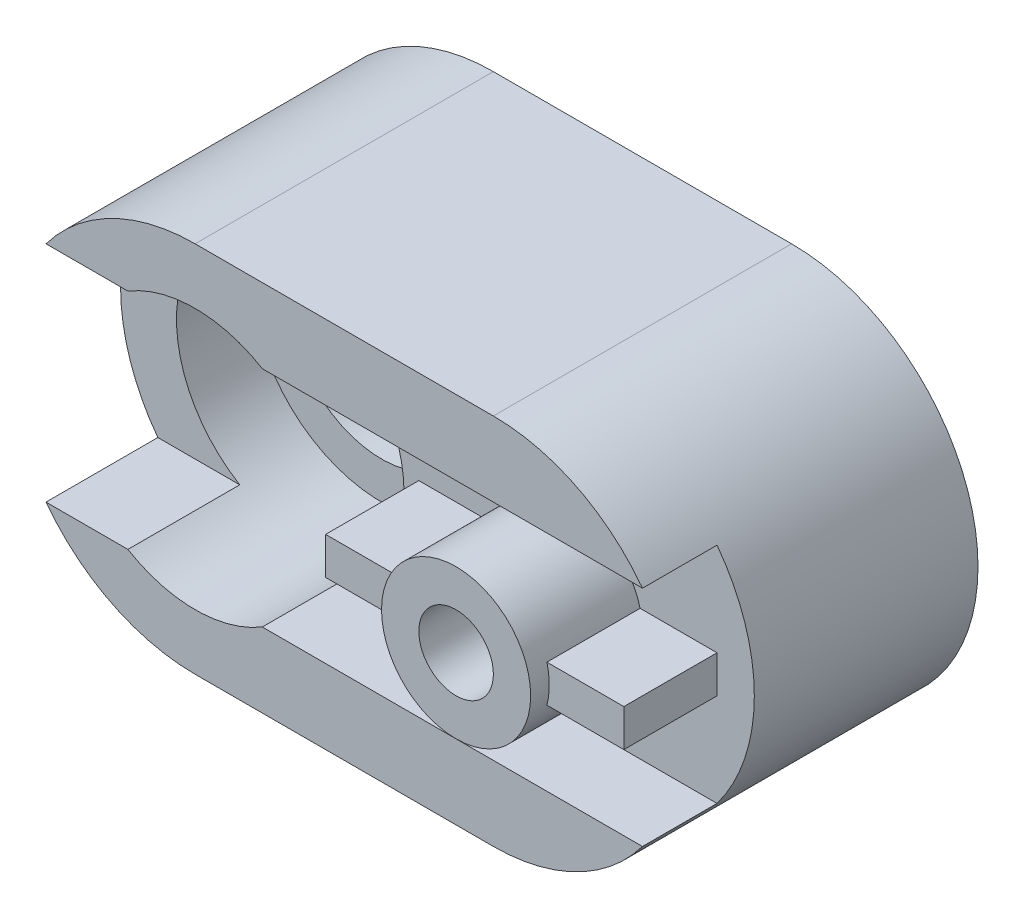
ISO-10303-21;
HEADER;
FILE_DESCRIPTION(('STEP AP214'),'2;1');
FILE_NAME('part.step','',(''),(''),'','','');
FILE_SCHEMA(('AUTOMOTIVE_DESIGN { 1 0 10303 214 1 1 1 1 }'));
ENDSEC;
DATA;
#1=APPLICATION_CONTEXT('core data for automotive mechanical design processes');
#2=APPLICATION_PROTOCOL_DEFINITION('international standard','automotive_design',2000,#1);
#3=PRODUCT_CONTEXT('',#1,'mechanical');
#4=PRODUCT('Part','Part','',(#3));
#5=PRODUCT_RELATED_PRODUCT_CATEGORY('part','',(#4));
#6=PRODUCT_DEFINITION_FORMATION('','',#4);
#7=PRODUCT_DEFINITION_CONTEXT('part definition',#1,'design');
#8=PRODUCT_DEFINITION('design','',#6,#7);
#9=PRODUCT_DEFINITION_SHAPE('','',#8);
#10=(LENGTH_UNIT() NAMED_UNIT(*) SI_UNIT(.MILLI.,.METRE.));
#11=(NAMED_UNIT(*) PLANE_ANGLE_UNIT() SI_UNIT($,.RADIAN.));
#12=(NAMED_UNIT(*) SI_UNIT($,.STERADIAN.) SOLID_ANGLE_UNIT());
#13=UNCERTAINTY_MEASURE_WITH_UNIT(LENGTH_MEASURE(1.E-05),#10,'distance_accuracy_value','');
#14=(GEOMETRIC_REPRESENTATION_CONTEXT(3) GLOBAL_UNCERTAINTY_ASSIGNED_CONTEXT((#13)) GLOBAL_UNIT_ASSIGNED_CONTEXT((#10,
#11,#12)) REPRESENTATION_CONTEXT('',''));
#15=CARTESIAN_POINT('',(0.,0.,0.));
#16=DIRECTION('',(0.,0.,1.));
#17=DIRECTION('',(1.,0.,0.));
#18=AXIS2_PLACEMENT_3D('',#15,#16,#17);
#19=CARTESIAN_POINT('',(209.,80.,60.));
#20=DIRECTION('',(0.,0.,1.));
#21=DIRECTION('',(1.,0.,0.));
#22=AXIS2_PLACEMENT_3D('',#19,#20,#21);
#23=PLANE('',#22);
#24=DIRECTION('',(-1.,0.,0.));
#25=VECTOR('',#24,1.);
#26=CARTESIAN_POINT('',(0.,55.,60.));
#27=LINE('',#26,#25);
#28=CARTESIAN_POINT('',(170.,55.,60.));
#29=VERTEX_POINT('',#28);
#30=CARTESIAN_POINT('',(149.364916731037,55.,60.));
#31=VERTEX_POINT('',#30);
#32=EDGE_CURVE('E204',#29,#31,#27,.T.);
#33=ORIENTED_EDGE('',*,*,#32,.F.);
#34=DIRECTION('',(0.,-1.,0.));
#35=VECTOR('',#34,1.);
#36=CARTESIAN_POINT('',(170.,0.,60.));
#37=LINE('',#36,#35);
#38=CARTESIAN_POINT('',(170.,45.,60.));
#39=VERTEX_POINT('',#38);
#40=EDGE_CURVE('E50',#29,#39,#37,.T.);
#41=ORIENTED_EDGE('',*,*,#40,.T.);
#42=DIRECTION('',(-1.,0.,0.));
#43=VECTOR('',#42,1.);
#44=CARTESIAN_POINT('',(0.,45.,60.));
#45=LINE('',#44,#43);
#46=CARTESIAN_POINT('',(149.364916731037,45.,60.));
#47=VERTEX_POINT('',#46);
#48=EDGE_CURVE('E237',#39,#47,#45,.T.);
#49=ORIENTED_EDGE('',*,*,#48,.T.);
#50=CARTESIAN_POINT('',(130.,50.,60.));
#51=DIRECTION('',(0.,0.,-1.));
#52=DIRECTION('',(1.,0.,0.));
#53=AXIS2_PLACEMENT_3D('',#50,#51,#52);
#54=CIRCLE('',#53,20.);
#55=CARTESIAN_POINT('',(110.635083268963,45.,60.));
#56=VERTEX_POINT('',#55);
#57=EDGE_CURVE('E296',#47,#56,#54,.T.);
#58=ORIENTED_EDGE('',*,*,#57,.T.);
#59=DIRECTION('',(1.,0.,0.));
#60=VECTOR('',#59,1.);
#61=CARTESIAN_POINT('',(0.,45.,60.));
#62=LINE('',#61,#60);
#63=CARTESIAN_POINT('',(90.,45.,60.));
#64=VERTEX_POINT('',#63);
#65=EDGE_CURVE('E224',#64,#56,#62,.T.);
#66=ORIENTED_EDGE('',*,*,#65,.F.);
#67=DIRECTION('',(0.,-1.,0.));
#68=VECTOR('',#67,1.);
#69=CARTESIAN_POINT('',(90.,0.,60.));
#70=LINE('',#69,#68);
#71=CARTESIAN_POINT('',(90.,55.,60.));
#72=VERTEX_POINT('',#71);
#73=EDGE_CURVE('E218',#72,#64,#70,.T.);
#74=ORIENTED_EDGE('',*,*,#73,.F.);
#75=DIRECTION('',(1.,0.,0.));
#76=VECTOR('',#75,1.);
#77=CARTESIAN_POINT('',(0.,55.,60.));
#78=LINE('',#77,#76);
#79=CARTESIAN_POINT('',(110.635083268963,55.,60.));
#80=VERTEX_POINT('',#79);
#81=EDGE_CURVE('E209',#72,#80,#78,.T.);
#82=ORIENTED_EDGE('',*,*,#81,.T.);
#83=EDGE_CURVE('E295',#80,#31,#54,.T.);
#84=ORIENTED_EDGE('',*,*,#83,.T.);
#85=EDGE_LOOP('',(#33,#41,#49,#58,#66,#74,#82,#84));
#86=FACE_BOUND('',#85,.T.);
#87=DIRECTION('',(-1.,0.,0.));
#88=VECTOR('',#87,1.);
#89=CARTESIAN_POINT('',(209.,80.,60.));
#90=LINE('',#89,#88);
#91=CARTESIAN_POINT('',(170.,80.,60.));
#92=VERTEX_POINT('',#91);
#93=CARTESIAN_POINT('',(70.,80.,60.));
#94=VERTEX_POINT('',#93);
#95=EDGE_CURVE('E317',#92,#94,#90,.T.);
#96=ORIENTED_EDGE('',*,*,#95,.T.);
#97=CARTESIAN_POINT('',(50.,50.,60.));
#98=DIRECTION('',(0.,0.,1.));
#99=DIRECTION('',(1.,0.,0.));
#100=AXIS2_PLACEMENT_3D('',#97,#98,#99);
#101=CIRCLE('',#100,36.0555127546399);
#102=CARTESIAN_POINT('',(70.,20.,60.));
#103=VERTEX_POINT('',#102);
#104=EDGE_CURVE('E265',#94,#103,#101,.F.);
#105=ORIENTED_EDGE('',*,*,#104,.T.);
#106=DIRECTION('',(-1.,0.,0.));
#107=VECTOR('',#106,1.);
#108=CARTESIAN_POINT('',(209.,20.,60.));
#109=LINE('',#108,#107);
#110=CARTESIAN_POINT('',(170.,20.,60.));
#111=VERTEX_POINT('',#110);
#112=EDGE_CURVE('E308',#111,#103,#109,.T.);
#113=ORIENTED_EDGE('',*,*,#112,.F.);
#114=CARTESIAN_POINT('',(130.,50.,60.));
#115=DIRECTION('',(0.,0.,1.));
#116=DIRECTION('',(1.,0.,0.));
#117=AXIS2_PLACEMENT_3D('',#114,#115,#116);
#118=CIRCLE('',#117,50.);
#119=EDGE_CURVE('E326',#92,#111,#118,.F.);
#120=ORIENTED_EDGE('',*,*,#119,.F.);
#121=EDGE_LOOP('',(#96,#105,#113,#120));
#122=FACE_BOUND('',#121,.T.);
#123=ADVANCED_FACE('F35',(#86,#122),#23,.T.);
#124=CARTESIAN_POINT('',(130.,50.,90.));
#125=DIRECTION('',(0.,0.,-1.));
#126=DIRECTION('',(-1.,0.,0.));
#127=AXIS2_PLACEMENT_3D('',#124,#125,#126);
#128=CYLINDRICAL_SURFACE('',#127,20.);
#129=CARTESIAN_POINT('',(130.,50.,90.));
#130=DIRECTION('',(0.,0.,1.));
#131=DIRECTION('',(1.,0.,0.));
#132=AXIS2_PLACEMENT_3D('',#129,#130,#131);
#133=CIRCLE('',#132,20.);
#134=CARTESIAN_POINT('',(150.,50.,90.));
#135=VERTEX_POINT('',#134);
#136=EDGE_CURVE('E305',#135,#135,#133,.T.);
#137=ORIENTED_EDGE('',*,*,#136,.F.);
#138=EDGE_LOOP('',(#137));
#139=FACE_BOUND('',#138,.T.);
#140=CARTESIAN_POINT('',(130.,50.,85.));
#141=DIRECTION('',(0.,0.,1.));
#142=DIRECTION('',(1.,0.,0.));
#143=AXIS2_PLACEMENT_3D('',#140,#141,#142);
#144=CIRCLE('',#143,20.);
#145=CARTESIAN_POINT('',(149.364916731037,55.,85.));
#146=VERTEX_POINT('',#145);
#147=CARTESIAN_POINT('',(149.364916731037,45.,85.));
#148=VERTEX_POINT('',#147);
#149=EDGE_CURVE('E58',#146,#148,#144,.F.);
#150=ORIENTED_EDGE('',*,*,#149,.F.);
#151=DIRECTION('',(0.,0.,1.));
#152=VECTOR('',#151,1.);
#153=CARTESIAN_POINT('',(149.364916731037,55.,60.));
#154=LINE('',#153,#152);
#155=EDGE_CURVE('E201',#31,#146,#154,.T.);
#156=ORIENTED_EDGE('',*,*,#155,.F.);
#157=ORIENTED_EDGE('',*,*,#83,.F.);
#158=DIRECTION('',(0.,0.,1.));
#159=VECTOR('',#158,1.);
#160=CARTESIAN_POINT('',(110.635083268963,55.,60.));
#161=LINE('',#160,#159);
#162=CARTESIAN_POINT('',(110.635083268963,55.,85.));
#163=VERTEX_POINT('',#162);
#164=EDGE_CURVE('E212',#80,#163,#161,.T.);
#165=ORIENTED_EDGE('',*,*,#164,.T.);
#166=CARTESIAN_POINT('',(130.,50.,85.));
#167=DIRECTION('',(0.,0.,1.));
#168=DIRECTION('',(1.,0.,0.));
#169=AXIS2_PLACEMENT_3D('',#166,#167,#168);
#170=CIRCLE('',#169,20.);
#171=CARTESIAN_POINT('',(110.635083268963,45.,85.));
#172=VERTEX_POINT('',#171);
#173=EDGE_CURVE('E221',#172,#163,#170,.F.);
#174=ORIENTED_EDGE('',*,*,#173,.F.);
#175=DIRECTION('',(0.,0.,-1.));
#176=VECTOR('',#175,1.);
#177=CARTESIAN_POINT('',(110.635083268963,45.,85.));
#178=LINE('',#177,#176);
#179=EDGE_CURVE('E229',#172,#56,#178,.T.);
#180=ORIENTED_EDGE('',*,*,#179,.T.);
#181=ORIENTED_EDGE('',*,*,#57,.F.);
#182=DIRECTION('',(0.,0.,-1.));
#183=VECTOR('',#182,1.);
#184=CARTESIAN_POINT('',(149.364916731037,45.,85.));
#185=LINE('',#184,#183);
#186=EDGE_CURVE('E240',#148,#47,#185,.T.);
#187=ORIENTED_EDGE('',*,*,#186,.F.);
#188=EDGE_LOOP('',(#150,#156,#157,#165,#174,#180,#181,#187));
#189=FACE_BOUND('',#188,.T.);
#190=ADVANCED_FACE('F444',(#139,#189),#128,.T.);
#191=CARTESIAN_POINT('',(209.,80.,80.));
#192=DIRECTION('',(0.,-1.,0.));
#193=DIRECTION('',(0.,0.,-1.));
#194=AXIS2_PLACEMENT_3D('',#191,#192,#193);
#195=PLANE('',#194);
#196=DIRECTION('',(1.,0.,0.));
#197=VECTOR('',#196,1.);
#198=CARTESIAN_POINT('',(0.,80.,80.));
#199=LINE('',#198,#197);
#200=CARTESIAN_POINT('',(68.02775637732,80.,80.));
#201=VERTEX_POINT('',#200);
#202=CARTESIAN_POINT('',(170.,80.,80.));
#203=VERTEX_POINT('',#202);
#204=EDGE_CURVE('E362',#201,#203,#199,.T.);
#205=ORIENTED_EDGE('',*,*,#204,.F.);
#206=DIRECTION('',(0.,0.,1.));
#207=VECTOR('',#206,1.);
#208=CARTESIAN_POINT('',(68.02775637732,80.,30.));
#209=LINE('',#208,#207);
#210=CARTESIAN_POINT('',(68.02775637732,80.,50.));
#211=VERTEX_POINT('',#210);
#212=EDGE_CURVE('E259',#211,#201,#209,.T.);
#213=ORIENTED_EDGE('',*,*,#212,.F.);
#214=DIRECTION('',(-1.,0.,0.));
#215=VECTOR('',#214,1.);
#216=CARTESIAN_POINT('',(0.,80.,50.));
#217=LINE('',#216,#215);
#218=CARTESIAN_POINT('',(70.,80.,50.));
#219=VERTEX_POINT('',#218);
#220=EDGE_CURVE('E270',#219,#211,#217,.T.);
#221=ORIENTED_EDGE('',*,*,#220,.F.);
#222=DIRECTION('',(0.,0.,1.));
#223=VECTOR('',#222,1.);
#224=CARTESIAN_POINT('',(70.,80.,50.));
#225=LINE('',#224,#223);
#226=EDGE_CURVE('E280',#219,#94,#225,.T.);
#227=ORIENTED_EDGE('',*,*,#226,.T.);
#228=ORIENTED_EDGE('',*,*,#95,.F.);
#229=DIRECTION('',(0.,0.,-1.));
#230=VECTOR('',#229,1.);
#231=CARTESIAN_POINT('',(170.,80.,80.));
#232=LINE('',#231,#230);
#233=EDGE_CURVE('E323',#203,#92,#232,.T.);
#234=ORIENTED_EDGE('',*,*,#233,.F.);
#235=EDGE_LOOP('',(#205,#213,#221,#227,#228,#234));
#236=FACE_BOUND('',#235,.T.);
#237=ADVANCED_FACE('F414',(#236),#195,.T.);
#238=CARTESIAN_POINT('',(209.,20.,80.));
#239=DIRECTION('',(0.,1.,0.));
#240=DIRECTION('',(0.,0.,1.));
#241=AXIS2_PLACEMENT_3D('',#238,#239,#240);
#242=PLANE('',#241);
#243=DIRECTION('',(-1.,0.,0.));
#244=VECTOR('',#243,1.);
#245=CARTESIAN_POINT('',(0.,20.,80.));
#246=LINE('',#245,#244);
#247=CARTESIAN_POINT('',(31.9722436226801,20.,80.));
#248=VERTEX_POINT('',#247);
#249=CARTESIAN_POINT('',(10.,20.,80.));
#250=VERTEX_POINT('',#249);
#251=EDGE_CURVE('E365',#248,#250,#246,.T.);
#252=ORIENTED_EDGE('',*,*,#251,.F.);
#253=DIRECTION('',(0.,0.,1.));
#254=VECTOR('',#253,1.);
#255=CARTESIAN_POINT('',(31.9722436226801,20.,30.));
#256=LINE('',#255,#254);
#257=CARTESIAN_POINT('',(31.9722436226801,20.,50.));
#258=VERTEX_POINT('',#257);
#259=EDGE_CURVE('E261',#258,#248,#256,.T.);
#260=ORIENTED_EDGE('',*,*,#259,.F.);
#261=DIRECTION('',(1.,0.,0.));
#262=VECTOR('',#261,1.);
#263=CARTESIAN_POINT('',(0.,20.,50.));
#264=LINE('',#263,#262);
#265=CARTESIAN_POINT('',(10.,20.,50.));
#266=VERTEX_POINT('',#265);
#267=EDGE_CURVE('E277',#266,#258,#264,.T.);
#268=ORIENTED_EDGE('',*,*,#267,.F.);
#269=DIRECTION('',(0.,0.,-1.));
#270=VECTOR('',#269,1.);
#271=CARTESIAN_POINT('',(10.,20.,80.));
#272=LINE('',#271,#270);
#273=EDGE_CURVE('E311',#266,#250,#272,.F.);
#274=ORIENTED_EDGE('',*,*,#273,.T.);
#275=EDGE_LOOP('',(#252,#260,#268,#274));
#276=FACE_BOUND('',#275,.T.);
#277=ADVANCED_FACE('F379',(#276),#242,.T.);
#278=CARTESIAN_POINT('',(50.,50.,20.));
#279=DIRECTION('',(0.,0.,1.));
#280=DIRECTION('',(1.,0.,0.));
#281=AXIS2_PLACEMENT_3D('',#278,#279,#280);
#282=CYLINDRICAL_SURFACE('',#281,25.);
#283=CARTESIAN_POINT('',(50.,50.,20.));
#284=DIRECTION('',(0.,0.,1.));
#285=DIRECTION('',(1.,0.,0.));
#286=AXIS2_PLACEMENT_3D('',#283,#284,#285);
#287=CIRCLE('',#286,25.);
#288=CARTESIAN_POINT('',(75.,50.,20.));
#289=VERTEX_POINT('',#288);
#290=EDGE_CURVE('E289',#289,#289,#287,.T.);
#291=ORIENTED_EDGE('',*,*,#290,.F.);
#292=EDGE_LOOP('',(#291));
#293=FACE_BOUND('',#292,.T.);
#294=CARTESIAN_POINT('',(50.,50.,30.));
#295=DIRECTION('',(0.,0.,1.));
#296=DIRECTION('',(1.,0.,0.));
#297=AXIS2_PLACEMENT_3D('',#294,#295,#296);
#298=CIRCLE('',#297,25.);
#299=CARTESIAN_POINT('',(75.,50.,30.));
#300=VERTEX_POINT('',#299);
#301=EDGE_CURVE('E251',#300,#300,#298,.T.);
#302=ORIENTED_EDGE('',*,*,#301,.T.);
#303=EDGE_LOOP('',(#302));
#304=FACE_BOUND('',#303,.T.);
#305=ADVANCED_FACE('F552',(#293,#304),#282,.F.);
#306=CARTESIAN_POINT('',(0.,0.,50.));
#307=DIRECTION('',(0.,0.,1.));
#308=DIRECTION('',(1.,0.,0.));
#309=AXIS2_PLACEMENT_3D('',#306,#307,#308);
#310=PLANE('',#309);
#311=CARTESIAN_POINT('',(50.,50.,50.));
#312=DIRECTION('',(0.,0.,1.));
#313=DIRECTION('',(1.,0.,0.));
#314=AXIS2_PLACEMENT_3D('',#311,#312,#313);
#315=CIRCLE('',#314,35.);
#316=CARTESIAN_POINT('',(31.9722436226801,80.,50.));
#317=VERTEX_POINT('',#316);
#318=EDGE_CURVE('E11',#317,#258,#315,.T.);
#319=ORIENTED_EDGE('',*,*,#318,.F.);
#320=CARTESIAN_POINT('',(10.,80.,50.));
#321=VERTEX_POINT('',#320);
#322=EDGE_CURVE('E269',#317,#321,#217,.T.);
#323=ORIENTED_EDGE('',*,*,#322,.T.);
#324=CARTESIAN_POINT('',(50.,50.,50.));
#325=DIRECTION('',(0.,0.,1.));
#326=DIRECTION('',(1.,0.,0.));
#327=AXIS2_PLACEMENT_3D('',#324,#325,#326);
#328=CIRCLE('',#327,50.);
#329=EDGE_CURVE('E273',#321,#266,#328,.T.);
#330=ORIENTED_EDGE('',*,*,#329,.T.);
#331=ORIENTED_EDGE('',*,*,#267,.T.);
#332=EDGE_LOOP('',(#319,#323,#330,#331));
#333=FACE_BOUND('',#332,.T.);
#334=ADVANCED_FACE('F424',(#333),#310,.T.);
#335=CARTESIAN_POINT('',(50.,50.,-14.));
#336=DIRECTION('',(0.,0.,1.));
#337=DIRECTION('',(1.,0.,0.));
#338=AXIS2_PLACEMENT_3D('',#335,#336,#337);
#339=CYLINDRICAL_SURFACE('',#338,10.);
#340=CARTESIAN_POINT('',(50.,50.,0.));
#341=DIRECTION('',(0.,0.,1.));
#342=DIRECTION('',(1.,0.,0.));
#343=AXIS2_PLACEMENT_3D('',#340,#341,#342);
#344=CIRCLE('',#343,10.);
#345=CARTESIAN_POINT('',(60.,50.,0.));
#346=VERTEX_POINT('',#345);
#347=EDGE_CURVE('E292',#346,#346,#344,.T.);
#348=ORIENTED_EDGE('',*,*,#347,.F.);
#349=EDGE_LOOP('',(#348));
#350=FACE_BOUND('',#349,.T.);
#351=CARTESIAN_POINT('',(50.,50.,20.));
#352=DIRECTION('',(0.,0.,1.));
#353=DIRECTION('',(1.,0.,0.));
#354=AXIS2_PLACEMENT_3D('',#351,#352,#353);
#355=CIRCLE('',#354,10.);
#356=CARTESIAN_POINT('',(60.,50.,20.));
#357=VERTEX_POINT('',#356);
#358=EDGE_CURVE('E285',#357,#357,#355,.T.);
#359=ORIENTED_EDGE('',*,*,#358,.T.);
#360=EDGE_LOOP('',(#359));
#361=FACE_BOUND('',#360,.T.);
#362=ADVANCED_FACE('F461',(#350,#361),#339,.F.);
#363=CARTESIAN_POINT('',(50.,50.,80.));
#364=DIRECTION('',(0.,0.,-1.));
#365=DIRECTION('',(-1.,0.,0.));
#366=AXIS2_PLACEMENT_3D('',#363,#364,#365);
#367=CYLINDRICAL_SURFACE('',#366,50.);
#368=ORIENTED_EDGE('',*,*,#273,.F.);
#369=ORIENTED_EDGE('',*,*,#329,.F.);
#370=DIRECTION('',(0.,0.,-1.));
#371=VECTOR('',#370,1.);
#372=CARTESIAN_POINT('',(10.,80.,80.));
#373=LINE('',#372,#371);
#374=CARTESIAN_POINT('',(10.,80.,80.));
#375=VERTEX_POINT('',#374);
#376=EDGE_CURVE('E320',#375,#321,#373,.T.);
#377=ORIENTED_EDGE('',*,*,#376,.F.);
#378=CARTESIAN_POINT('',(50.,50.,80.));
#379=DIRECTION('',(0.,0.,1.));
#380=DIRECTION('',(1.,0.,0.));
#381=AXIS2_PLACEMENT_3D('',#378,#379,#380);
#382=CIRCLE('',#381,50.);
#383=CARTESIAN_POINT('',(50.,100.,80.));
#384=VERTEX_POINT('',#383);
#385=EDGE_CURVE('E337',#384,#375,#382,.T.);
#386=ORIENTED_EDGE('',*,*,#385,.F.);
#387=DIRECTION('',(0.,0.,-1.));
#388=VECTOR('',#387,1.);
#389=CARTESIAN_POINT('',(50.,100.,80.));
#390=LINE('',#389,#388);
#391=CARTESIAN_POINT('',(50.,100.,0.));
#392=VERTEX_POINT('',#391);
#393=EDGE_CURVE('E358',#384,#392,#390,.T.);
#394=ORIENTED_EDGE('',*,*,#393,.T.);
#395=CARTESIAN_POINT('',(50.,50.,0.));
#396=DIRECTION('',(0.,0.,1.));
#397=DIRECTION('',(1.,0.,0.));
#398=AXIS2_PLACEMENT_3D('',#395,#396,#397);
#399=CIRCLE('',#398,50.);
#400=CARTESIAN_POINT('',(50.,0.,0.));
#401=VERTEX_POINT('',#400);
#402=EDGE_CURVE('E349',#392,#401,#399,.T.);
#403=ORIENTED_EDGE('',*,*,#402,.T.);
#404=DIRECTION('',(0.,0.,-1.));
#405=VECTOR('',#404,1.);
#406=CARTESIAN_POINT('',(50.,0.,80.));
#407=LINE('',#406,#405);
#408=CARTESIAN_POINT('',(50.,0.,80.));
#409=VERTEX_POINT('',#408);
#410=EDGE_CURVE('E355',#409,#401,#407,.T.);
#411=ORIENTED_EDGE('',*,*,#410,.F.);
#412=EDGE_CURVE('E336',#250,#409,#382,.T.);
#413=ORIENTED_EDGE('',*,*,#412,.F.);
#414=EDGE_LOOP('',(#368,#369,#377,#386,#394,#403,#411,#413));
#415=FACE_BOUND('',#414,.T.);
#416=ADVANCED_FACE('F382',(#415),#367,.T.);
#417=CARTESIAN_POINT('',(130.,50.,80.));
#418=DIRECTION('',(0.,0.,-1.));
#419=DIRECTION('',(-1.,0.,0.));
#420=AXIS2_PLACEMENT_3D('',#417,#418,#419);
#421=CYLINDRICAL_SURFACE('',#420,50.);
#422=ORIENTED_EDGE('',*,*,#119,.T.);
#423=DIRECTION('',(0.,0.,-1.));
#424=VECTOR('',#423,1.);
#425=CARTESIAN_POINT('',(170.,20.,80.));
#426=LINE('',#425,#424);
#427=CARTESIAN_POINT('',(170.,20.,80.));
#428=VERTEX_POINT('',#427);
#429=EDGE_CURVE('E314',#111,#428,#426,.F.);
#430=ORIENTED_EDGE('',*,*,#429,.T.);
#431=CARTESIAN_POINT('',(130.,50.,80.));
#432=DIRECTION('',(0.,0.,1.));
#433=DIRECTION('',(1.,0.,0.));
#434=AXIS2_PLACEMENT_3D('',#431,#432,#433);
#435=CIRCLE('',#434,50.);
#436=CARTESIAN_POINT('',(130.,0.,80.));
#437=VERTEX_POINT('',#436);
#438=EDGE_CURVE('E333',#428,#437,#435,.F.);
#439=ORIENTED_EDGE('',*,*,#438,.T.);
#440=DIRECTION('',(0.,0.,-1.));
#441=VECTOR('',#440,1.);
#442=CARTESIAN_POINT('',(130.,0.,80.));
#443=LINE('',#442,#441);
#444=CARTESIAN_POINT('',(130.,0.,0.));
#445=VERTEX_POINT('',#444);
#446=EDGE_CURVE('E343',#437,#445,#443,.T.);
#447=ORIENTED_EDGE('',*,*,#446,.T.);
#448=CARTESIAN_POINT('',(130.,50.,0.));
#449=DIRECTION('',(0.,0.,1.));
#450=DIRECTION('',(1.,0.,0.));
#451=AXIS2_PLACEMENT_3D('',#448,#449,#450);
#452=CIRCLE('',#451,50.);
#453=CARTESIAN_POINT('',(130.,100.,0.));
#454=VERTEX_POINT('',#453);
#455=EDGE_CURVE('E328',#454,#445,#452,.F.);
#456=ORIENTED_EDGE('',*,*,#455,.F.);
#457=DIRECTION('',(0.,0.,-1.));
#458=VECTOR('',#457,1.);
#459=CARTESIAN_POINT('',(130.,100.,80.));
#460=LINE('',#459,#458);
#461=CARTESIAN_POINT('',(130.,100.,80.));
#462=VERTEX_POINT('',#461);
#463=EDGE_CURVE('E360',#462,#454,#460,.T.);
#464=ORIENTED_EDGE('',*,*,#463,.F.);
#465=EDGE_CURVE('E329',#462,#203,#435,.F.);
#466=ORIENTED_EDGE('',*,*,#465,.T.);
#467=ORIENTED_EDGE('',*,*,#233,.T.);
#468=EDGE_LOOP('',(#422,#430,#439,#447,#456,#464,#466,#467));
#469=FACE_BOUND('',#468,.T.);
#470=ADVANCED_FACE('F37',(#469),#421,.T.);
#471=CARTESIAN_POINT('',(0.,0.,80.));
#472=DIRECTION('',(0.,0.,1.));
#473=DIRECTION('',(1.,0.,0.));
#474=AXIS2_PLACEMENT_3D('',#471,#472,#473);
#475=PLANE('',#474);
#476=CARTESIAN_POINT('',(50.,50.,80.));
#477=DIRECTION('',(0.,0.,1.));
#478=DIRECTION('',(1.,0.,0.));
#479=AXIS2_PLACEMENT_3D('',#476,#477,#478);
#480=CIRCLE('',#479,35.);
#481=CARTESIAN_POINT('',(68.0277563773199,20.,80.));
#482=VERTEX_POINT('',#481);
#483=EDGE_CURVE('E247',#248,#482,#480,.T.);
#484=ORIENTED_EDGE('',*,*,#483,.F.);
#485=ORIENTED_EDGE('',*,*,#251,.T.);
#486=ORIENTED_EDGE('',*,*,#412,.T.);
#487=DIRECTION('',(1.,0.,0.));
#488=VECTOR('',#487,1.);
#489=CARTESIAN_POINT('',(0.,0.,80.));
#490=LINE('',#489,#488);
#491=EDGE_CURVE('E340',#409,#437,#490,.T.);
#492=ORIENTED_EDGE('',*,*,#491,.T.);
#493=ORIENTED_EDGE('',*,*,#438,.F.);
#494=EDGE_CURVE('E366',#428,#482,#246,.T.);
#495=ORIENTED_EDGE('',*,*,#494,.T.);
#496=EDGE_LOOP('',(#484,#485,#486,#492,#493,#495));
#497=FACE_BOUND('',#496,.T.);
#498=ADVANCED_FACE('F372',(#497),#475,.T.);
#499=CARTESIAN_POINT('',(31.9722436226801,80.,80.));
#500=VERTEX_POINT('',#499);
#501=EDGE_CURVE('E248',#201,#500,#480,.T.);
#502=ORIENTED_EDGE('',*,*,#501,.F.);
#503=ORIENTED_EDGE('',*,*,#204,.T.);
#504=ORIENTED_EDGE('',*,*,#465,.F.);
#505=DIRECTION('',(1.,0.,0.));
#506=VECTOR('',#505,1.);
#507=CARTESIAN_POINT('',(0.,100.,80.));
#508=LINE('',#507,#506);
#509=EDGE_CURVE('E332',#384,#462,#508,.T.);
#510=ORIENTED_EDGE('',*,*,#509,.F.);
#511=ORIENTED_EDGE('',*,*,#385,.T.);
#512=EDGE_CURVE('E363',#375,#500,#199,.T.);
#513=ORIENTED_EDGE('',*,*,#512,.T.);
#514=EDGE_LOOP('',(#502,#503,#504,#510,#511,#513));
#515=FACE_BOUND('',#514,.T.);
#516=ADVANCED_FACE('F418',(#515),#475,.T.);
#517=CARTESIAN_POINT('',(0.,100.,80.));
#518=DIRECTION('',(0.,1.,0.));
#519=DIRECTION('',(0.,0.,1.));
#520=AXIS2_PLACEMENT_3D('',#517,#518,#519);
#521=PLANE('',#520);
#522=DIRECTION('',(1.,0.,0.));
#523=VECTOR('',#522,1.);
#524=CARTESIAN_POINT('',(0.,100.,0.));
#525=LINE('',#524,#523);
#526=EDGE_CURVE('E346',#392,#454,#525,.T.);
#527=ORIENTED_EDGE('',*,*,#526,.F.);
#528=ORIENTED_EDGE('',*,*,#393,.F.);
#529=ORIENTED_EDGE('',*,*,#509,.T.);
#530=ORIENTED_EDGE('',*,*,#463,.T.);
#531=EDGE_LOOP('',(#527,#528,#529,#530));
#532=FACE_BOUND('',#531,.T.);
#533=ADVANCED_FACE('F430',(#532),#521,.T.);
#534=CARTESIAN_POINT('',(0.,0.,80.));
#535=DIRECTION('',(0.,1.,0.));
#536=DIRECTION('',(0.,0.,1.));
#537=AXIS2_PLACEMENT_3D('',#534,#535,#536);
#538=PLANE('',#537);
#539=DIRECTION('',(1.,0.,0.));
#540=VECTOR('',#539,1.);
#541=CARTESIAN_POINT('',(0.,0.,0.));
#542=LINE('',#541,#540);
#543=EDGE_CURVE('E351',#401,#445,#542,.T.);
#544=ORIENTED_EDGE('',*,*,#543,.T.);
#545=ORIENTED_EDGE('',*,*,#446,.F.);
#546=ORIENTED_EDGE('',*,*,#491,.F.);
#547=ORIENTED_EDGE('',*,*,#410,.T.);
#548=EDGE_LOOP('',(#544,#545,#546,#547));
#549=FACE_BOUND('',#548,.T.);
#550=ADVANCED_FACE('F388',(#549),#538,.F.);
#551=CARTESIAN_POINT('',(0.,0.,0.));
#552=DIRECTION('',(0.,0.,1.));
#553=DIRECTION('',(1.,0.,0.));
#554=AXIS2_PLACEMENT_3D('',#551,#552,#553);
#555=PLANE('',#554);
#556=ORIENTED_EDGE('',*,*,#347,.T.);
#557=EDGE_LOOP('',(#556));
#558=FACE_BOUND('',#557,.T.);
#559=ORIENTED_EDGE('',*,*,#455,.T.);
#560=ORIENTED_EDGE('',*,*,#543,.F.);
#561=ORIENTED_EDGE('',*,*,#402,.F.);
#562=ORIENTED_EDGE('',*,*,#526,.T.);
#563=EDGE_LOOP('',(#559,#560,#561,#562));
#564=FACE_BOUND('',#563,.T.);
#565=ADVANCED_FACE('F432',(#558,#564),#555,.F.);
#566=DIRECTION('',(0.,0.,1.));
#567=VECTOR('',#566,1.);
#568=CARTESIAN_POINT('',(31.9722436226801,80.,30.));
#569=LINE('',#568,#567);
#570=EDGE_CURVE('E263',#500,#317,#569,.F.);
#571=ORIENTED_EDGE('',*,*,#570,.F.);
#572=ORIENTED_EDGE('',*,*,#512,.F.);
#573=ORIENTED_EDGE('',*,*,#376,.T.);
#574=ORIENTED_EDGE('',*,*,#322,.F.);
#575=EDGE_LOOP('',(#571,#572,#573,#574));
#576=FACE_BOUND('',#575,.T.);
#577=ADVANCED_FACE('F425',(#576),#195,.T.);
#578=DIRECTION('',(0.,0.,1.));
#579=VECTOR('',#578,1.);
#580=CARTESIAN_POINT('',(68.0277563773199,20.,30.));
#581=LINE('',#580,#579);
#582=CARTESIAN_POINT('',(68.0277563773199,20.,50.));
#583=VERTEX_POINT('',#582);
#584=EDGE_CURVE('E257',#482,#583,#581,.F.);
#585=ORIENTED_EDGE('',*,*,#584,.F.);
#586=ORIENTED_EDGE('',*,*,#494,.F.);
#587=ORIENTED_EDGE('',*,*,#429,.F.);
#588=ORIENTED_EDGE('',*,*,#112,.T.);
#589=DIRECTION('',(0.,0.,1.));
#590=VECTOR('',#589,1.);
#591=CARTESIAN_POINT('',(70.,20.,50.));
#592=LINE('',#591,#590);
#593=CARTESIAN_POINT('',(70.,20.,50.));
#594=VERTEX_POINT('',#593);
#595=EDGE_CURVE('E283',#594,#103,#592,.T.);
#596=ORIENTED_EDGE('',*,*,#595,.F.);
#597=EDGE_CURVE('E276',#583,#594,#264,.T.);
#598=ORIENTED_EDGE('',*,*,#597,.F.);
#599=EDGE_LOOP('',(#585,#586,#587,#588,#596,#598));
#600=FACE_BOUND('',#599,.T.);
#601=ADVANCED_FACE('F394',(#600),#242,.T.);
#602=CARTESIAN_POINT('',(130.,50.,90.));
#603=DIRECTION('',(0.,0.,1.));
#604=DIRECTION('',(1.,0.,0.));
#605=AXIS2_PLACEMENT_3D('',#602,#603,#604);
#606=PLANE('',#605);
#607=ORIENTED_EDGE('',*,*,#136,.T.);
#608=EDGE_LOOP('',(#607));
#609=FACE_BOUND('',#608,.T.);
#610=CARTESIAN_POINT('',(130.,50.,90.));
#611=DIRECTION('',(0.,0.,1.));
#612=DIRECTION('',(1.,0.,0.));
#613=AXIS2_PLACEMENT_3D('',#610,#611,#612);
#614=CIRCLE('',#613,10.);
#615=CARTESIAN_POINT('',(140.,50.,90.));
#616=VERTEX_POINT('',#615);
#617=EDGE_CURVE('E302',#616,#616,#614,.T.);
#618=ORIENTED_EDGE('',*,*,#617,.F.);
#619=EDGE_LOOP('',(#618));
#620=FACE_BOUND('',#619,.T.);
#621=ADVANCED_FACE('F483',(#609,#620),#606,.T.);
#622=CARTESIAN_POINT('',(130.,50.,40.));
#623=DIRECTION('',(0.,0.,1.));
#624=DIRECTION('',(1.,0.,0.));
#625=AXIS2_PLACEMENT_3D('',#622,#623,#624);
#626=CYLINDRICAL_SURFACE('',#625,10.);
#627=CARTESIAN_POINT('',(130.,50.,40.));
#628=DIRECTION('',(0.,0.,1.));
#629=DIRECTION('',(1.,0.,0.));
#630=AXIS2_PLACEMENT_3D('',#627,#628,#629);
#631=CIRCLE('',#630,9.99999999999998);
#632=CARTESIAN_POINT('',(140.,50.,40.));
#633=VERTEX_POINT('',#632);
#634=EDGE_CURVE('E299',#633,#633,#631,.T.);
#635=ORIENTED_EDGE('',*,*,#634,.F.);
#636=EDGE_LOOP('',(#635));
#637=FACE_BOUND('',#636,.T.);
#638=ORIENTED_EDGE('',*,*,#617,.T.);
#639=EDGE_LOOP('',(#638));
#640=FACE_BOUND('',#639,.T.);
#641=ADVANCED_FACE('F488',(#637,#640),#626,.F.);
#642=CARTESIAN_POINT('',(130.,50.,40.));
#643=DIRECTION('',(0.,0.,1.));
#644=DIRECTION('',(1.,0.,0.));
#645=AXIS2_PLACEMENT_3D('',#642,#643,#644);
#646=CONICAL_SURFACE('',#645,9.99999999999998,1.02974425867666);
#647=CARTESIAN_POINT('',(130.,50.,33.9913938097244));
#648=VERTEX_POINT('',#647);
#649=VERTEX_LOOP('',#648);
#650=FACE_BOUND('',#649,.T.);
#651=ORIENTED_EDGE('',*,*,#634,.T.);
#652=EDGE_LOOP('',(#651));
#653=FACE_BOUND('',#652,.T.);
#654=ADVANCED_FACE('F500',(#650,#653),#646,.F.);
#655=CARTESIAN_POINT('',(50.,50.,20.));
#656=DIRECTION('',(0.,0.,1.));
#657=DIRECTION('',(1.,0.,0.));
#658=AXIS2_PLACEMENT_3D('',#655,#656,#657);
#659=PLANE('',#658);
#660=ORIENTED_EDGE('',*,*,#358,.F.);
#661=EDGE_LOOP('',(#660));
#662=FACE_BOUND('',#661,.T.);
#663=ORIENTED_EDGE('',*,*,#290,.T.);
#664=EDGE_LOOP('',(#663));
#665=FACE_BOUND('',#664,.T.);
#666=ADVANCED_FACE('F509',(#662,#665),#659,.T.);
#667=CARTESIAN_POINT('',(50.,50.,50.));
#668=DIRECTION('',(0.,0.,1.));
#669=DIRECTION('',(1.,0.,0.));
#670=AXIS2_PLACEMENT_3D('',#667,#668,#669);
#671=CYLINDRICAL_SURFACE('',#670,36.0555127546399);
#672=ORIENTED_EDGE('',*,*,#104,.F.);
#673=ORIENTED_EDGE('',*,*,#226,.F.);
#674=CARTESIAN_POINT('',(50.,50.,50.));
#675=DIRECTION('',(0.,0.,1.));
#676=DIRECTION('',(1.,0.,0.));
#677=AXIS2_PLACEMENT_3D('',#674,#675,#676);
#678=CIRCLE('',#677,36.0555127546399);
#679=EDGE_CURVE('E266',#219,#594,#678,.F.);
#680=ORIENTED_EDGE('',*,*,#679,.T.);
#681=ORIENTED_EDGE('',*,*,#595,.T.);
#682=EDGE_LOOP('',(#672,#673,#680,#681));
#683=FACE_BOUND('',#682,.T.);
#684=ADVANCED_FACE('F400',(#683),#671,.F.);
#685=EDGE_CURVE('E39',#583,#211,#315,.T.);
#686=ORIENTED_EDGE('',*,*,#685,.F.);
#687=ORIENTED_EDGE('',*,*,#597,.T.);
#688=ORIENTED_EDGE('',*,*,#679,.F.);
#689=ORIENTED_EDGE('',*,*,#220,.T.);
#690=EDGE_LOOP('',(#686,#687,#688,#689));
#691=FACE_BOUND('',#690,.T.);
#692=ADVANCED_FACE('F405',(#691),#310,.T.);
#693=CARTESIAN_POINT('',(50.,50.,30.));
#694=DIRECTION('',(0.,0.,1.));
#695=DIRECTION('',(1.,0.,0.));
#696=AXIS2_PLACEMENT_3D('',#693,#694,#695);
#697=CYLINDRICAL_SURFACE('',#696,35.);
#698=ORIENTED_EDGE('',*,*,#570,.T.);
#699=ORIENTED_EDGE('',*,*,#318,.T.);
#700=ORIENTED_EDGE('',*,*,#259,.T.);
#701=ORIENTED_EDGE('',*,*,#483,.T.);
#702=ORIENTED_EDGE('',*,*,#584,.T.);
#703=ORIENTED_EDGE('',*,*,#685,.T.);
#704=ORIENTED_EDGE('',*,*,#212,.T.);
#705=ORIENTED_EDGE('',*,*,#501,.T.);
#706=EDGE_LOOP('',(#698,#699,#700,#701,#702,#703,#704,#705));
#707=FACE_BOUND('',#706,.T.);
#708=CARTESIAN_POINT('',(50.,50.,30.));
#709=DIRECTION('',(0.,0.,1.));
#710=DIRECTION('',(1.,0.,0.));
#711=AXIS2_PLACEMENT_3D('',#708,#709,#710);
#712=CIRCLE('',#711,35.);
#713=CARTESIAN_POINT('',(85.,50.,30.));
#714=VERTEX_POINT('',#713);
#715=EDGE_CURVE('E254',#714,#714,#712,.T.);
#716=ORIENTED_EDGE('',*,*,#715,.F.);
#717=EDGE_LOOP('',(#716));
#718=FACE_BOUND('',#717,.T.);
#719=ADVANCED_FACE('F409',(#707,#718),#697,.F.);
#720=CARTESIAN_POINT('',(50.,50.,30.));
#721=DIRECTION('',(0.,0.,1.));
#722=DIRECTION('',(1.,0.,0.));
#723=AXIS2_PLACEMENT_3D('',#720,#721,#722);
#724=PLANE('',#723);
#725=ORIENTED_EDGE('',*,*,#301,.F.);
#726=EDGE_LOOP('',(#725));
#727=FACE_BOUND('',#726,.T.);
#728=ORIENTED_EDGE('',*,*,#715,.T.);
#729=EDGE_LOOP('',(#728));
#730=FACE_BOUND('',#729,.T.);
#731=ADVANCED_FACE('F577',(#727,#730),#724,.T.);
#732=CARTESIAN_POINT('',(0.,45.,85.));
#733=DIRECTION('',(0.,-1.,0.));
#734=DIRECTION('',(0.,0.,-1.));
#735=AXIS2_PLACEMENT_3D('',#732,#733,#734);
#736=PLANE('',#735);
#737=ORIENTED_EDGE('',*,*,#48,.F.);
#738=DIRECTION('',(0.,0.,-1.));
#739=VECTOR('',#738,1.);
#740=CARTESIAN_POINT('',(170.,45.,85.));
#741=LINE('',#740,#739);
#742=CARTESIAN_POINT('',(170.,45.,85.));
#743=VERTEX_POINT('',#742);
#744=EDGE_CURVE('E245',#743,#39,#741,.T.);
#745=ORIENTED_EDGE('',*,*,#744,.F.);
#746=DIRECTION('',(-1.,0.,0.));
#747=VECTOR('',#746,1.);
#748=CARTESIAN_POINT('',(0.,45.,85.));
#749=LINE('',#748,#747);
#750=EDGE_CURVE('E193',#743,#148,#749,.T.);
#751=ORIENTED_EDGE('',*,*,#750,.T.);
#752=ORIENTED_EDGE('',*,*,#186,.T.);
#753=EDGE_LOOP('',(#737,#745,#751,#752));
#754=FACE_BOUND('',#753,.T.);
#755=ADVANCED_FACE('F582',(#754),#736,.T.);
#756=CARTESIAN_POINT('',(170.,0.,85.));
#757=DIRECTION('',(1.,0.,0.));
#758=DIRECTION('',(0.,0.,-1.));
#759=AXIS2_PLACEMENT_3D('',#756,#757,#758);
#760=PLANE('',#759);
#761=ORIENTED_EDGE('',*,*,#40,.F.);
#762=DIRECTION('',(0.,0.,1.));
#763=VECTOR('',#762,1.);
#764=CARTESIAN_POINT('',(170.,55.,60.));
#765=LINE('',#764,#763);
#766=CARTESIAN_POINT('',(170.,55.,85.));
#767=VERTEX_POINT('',#766);
#768=EDGE_CURVE('E196',#29,#767,#765,.T.);
#769=ORIENTED_EDGE('',*,*,#768,.T.);
#770=DIRECTION('',(0.,-1.,0.));
#771=VECTOR('',#770,1.);
#772=CARTESIAN_POINT('',(170.,0.,85.));
#773=LINE('',#772,#771);
#774=EDGE_CURVE('E188',#767,#743,#773,.T.);
#775=ORIENTED_EDGE('',*,*,#774,.T.);
#776=ORIENTED_EDGE('',*,*,#744,.T.);
#777=EDGE_LOOP('',(#761,#769,#775,#776));
#778=FACE_BOUND('',#777,.T.);
#779=ADVANCED_FACE('F197',(#778),#760,.T.);
#780=CARTESIAN_POINT('',(0.,0.,85.));
#781=DIRECTION('',(0.,0.,1.));
#782=DIRECTION('',(1.,0.,0.));
#783=AXIS2_PLACEMENT_3D('',#780,#781,#782);
#784=PLANE('',#783);
#785=ORIENTED_EDGE('',*,*,#750,.F.);
#786=ORIENTED_EDGE('',*,*,#774,.F.);
#787=DIRECTION('',(-1.,0.,0.));
#788=VECTOR('',#787,1.);
#789=CARTESIAN_POINT('',(0.,55.,85.));
#790=LINE('',#789,#788);
#791=EDGE_CURVE('E191',#767,#146,#790,.T.);
#792=ORIENTED_EDGE('',*,*,#791,.T.);
#793=ORIENTED_EDGE('',*,*,#149,.T.);
#794=EDGE_LOOP('',(#785,#786,#792,#793));
#795=FACE_BOUND('',#794,.T.);
#796=ADVANCED_FACE('F189',(#795),#784,.T.);
#797=CARTESIAN_POINT('',(90.,0.,85.));
#798=DIRECTION('',(1.,0.,0.));
#799=DIRECTION('',(0.,0.,-1.));
#800=AXIS2_PLACEMENT_3D('',#797,#798,#799);
#801=PLANE('',#800);
#802=ORIENTED_EDGE('',*,*,#73,.T.);
#803=DIRECTION('',(0.,0.,-1.));
#804=VECTOR('',#803,1.);
#805=CARTESIAN_POINT('',(90.,45.,85.));
#806=LINE('',#805,#804);
#807=CARTESIAN_POINT('',(90.,45.,85.));
#808=VERTEX_POINT('',#807);
#809=EDGE_CURVE('E234',#808,#64,#806,.T.);
#810=ORIENTED_EDGE('',*,*,#809,.F.);
#811=DIRECTION('',(0.,-1.,0.));
#812=VECTOR('',#811,1.);
#813=CARTESIAN_POINT('',(90.,0.,85.));
#814=LINE('',#813,#812);
#815=CARTESIAN_POINT('',(90.,55.,85.));
#816=VERTEX_POINT('',#815);
#817=EDGE_CURVE('E223',#816,#808,#814,.T.);
#818=ORIENTED_EDGE('',*,*,#817,.F.);
#819=DIRECTION('',(0.,0.,1.));
#820=VECTOR('',#819,1.);
#821=CARTESIAN_POINT('',(90.,55.,60.));
#822=LINE('',#821,#820);
#823=EDGE_CURVE('E215',#72,#816,#822,.T.);
#824=ORIENTED_EDGE('',*,*,#823,.F.);
#825=EDGE_LOOP('',(#802,#810,#818,#824));
#826=FACE_BOUND('',#825,.T.);
#827=ADVANCED_FACE('F654',(#826),#801,.F.);
#828=CARTESIAN_POINT('',(0.,45.,85.));
#829=DIRECTION('',(0.,1.,0.));
#830=DIRECTION('',(0.,0.,1.));
#831=AXIS2_PLACEMENT_3D('',#828,#829,#830);
#832=PLANE('',#831);
#833=ORIENTED_EDGE('',*,*,#65,.T.);
#834=ORIENTED_EDGE('',*,*,#179,.F.);
#835=DIRECTION('',(1.,0.,0.));
#836=VECTOR('',#835,1.);
#837=CARTESIAN_POINT('',(0.,45.,85.));
#838=LINE('',#837,#836);
#839=EDGE_CURVE('E226',#808,#172,#838,.T.);
#840=ORIENTED_EDGE('',*,*,#839,.F.);
#841=ORIENTED_EDGE('',*,*,#809,.T.);
#842=EDGE_LOOP('',(#833,#834,#840,#841));
#843=FACE_BOUND('',#842,.T.);
#844=ADVANCED_FACE('F648',(#843),#832,.F.);
#845=CARTESIAN_POINT('',(0.,0.,85.));
#846=DIRECTION('',(0.,0.,1.));
#847=DIRECTION('',(1.,0.,0.));
#848=AXIS2_PLACEMENT_3D('',#845,#846,#847);
#849=PLANE('',#848);
#850=ORIENTED_EDGE('',*,*,#173,.T.);
#851=DIRECTION('',(1.,0.,0.));
#852=VECTOR('',#851,1.);
#853=CARTESIAN_POINT('',(0.,55.,85.));
#854=LINE('',#853,#852);
#855=EDGE_CURVE('E200',#816,#163,#854,.T.);
#856=ORIENTED_EDGE('',*,*,#855,.F.);
#857=ORIENTED_EDGE('',*,*,#817,.T.);
#858=ORIENTED_EDGE('',*,*,#839,.T.);
#859=EDGE_LOOP('',(#850,#856,#857,#858));
#860=FACE_BOUND('',#859,.T.);
#861=ADVANCED_FACE('F653',(#860),#849,.T.);
#862=CARTESIAN_POINT('',(0.,55.,60.));
#863=DIRECTION('',(0.,-1.,0.));
#864=DIRECTION('',(0.,0.,-1.));
#865=AXIS2_PLACEMENT_3D('',#862,#863,#864);
#866=PLANE('',#865);
#867=ORIENTED_EDGE('',*,*,#855,.T.);
#868=ORIENTED_EDGE('',*,*,#164,.F.);
#869=ORIENTED_EDGE('',*,*,#81,.F.);
#870=ORIENTED_EDGE('',*,*,#823,.T.);
#871=EDGE_LOOP('',(#867,#868,#869,#870));
#872=FACE_BOUND('',#871,.T.);
#873=ADVANCED_FACE('F679',(#872),#866,.F.);
#874=CARTESIAN_POINT('',(0.,55.,60.));
#875=DIRECTION('',(0.,1.,0.));
#876=DIRECTION('',(0.,0.,1.));
#877=AXIS2_PLACEMENT_3D('',#874,#875,#876);
#878=PLANE('',#877);
#879=ORIENTED_EDGE('',*,*,#791,.F.);
#880=ORIENTED_EDGE('',*,*,#768,.F.);
#881=ORIENTED_EDGE('',*,*,#32,.T.);
#882=ORIENTED_EDGE('',*,*,#155,.T.);
#883=EDGE_LOOP('',(#879,#880,#881,#882));
#884=FACE_BOUND('',#883,.T.);
#885=ADVANCED_FACE('F203',(#884),#878,.T.);
#886=CLOSED_SHELL('',(#123,#190,#237,#277,#305,#334,#362,#416,#470,#498,#516,#533,#550,#565,
#577,#601,#621,#641,#654,#666,#684,#692,#719,#731,#755,#779,#796,#827,#844,#861,#873,#885));
#887=MANIFOLD_SOLID_BREP('B2',#886);
#888=ADVANCED_BREP_SHAPE_REPRESENTATION('',(#18,#887),#14);
#889=SHAPE_DEFINITION_REPRESENTATION(#9,#888);
ENDSEC;
END-ISO-10303-21;
